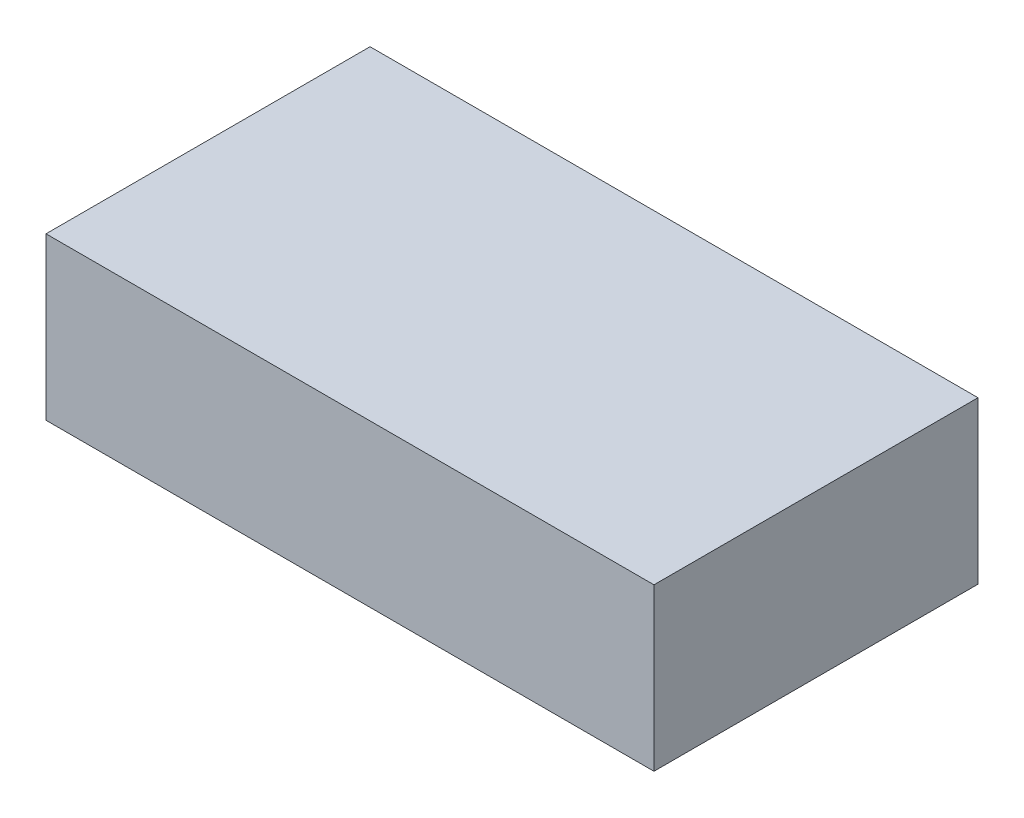
ISO-10303-21;
HEADER;
FILE_DESCRIPTION(('STEP AP214'),'2;1');
FILE_NAME('part.step','',(''),(''),'','','');
FILE_SCHEMA(('AUTOMOTIVE_DESIGN { 1 0 10303 214 1 1 1 1 }'));
ENDSEC;
DATA;
#1=APPLICATION_CONTEXT('core data for automotive mechanical design processes');
#2=APPLICATION_PROTOCOL_DEFINITION('international standard','automotive_design',2000,#1);
#3=PRODUCT_CONTEXT('',#1,'mechanical');
#4=PRODUCT('Part','Part','',(#3));
#5=PRODUCT_RELATED_PRODUCT_CATEGORY('part','',(#4));
#6=PRODUCT_DEFINITION_FORMATION('','',#4);
#7=PRODUCT_DEFINITION_CONTEXT('part definition',#1,'design');
#8=PRODUCT_DEFINITION('design','',#6,#7);
#9=PRODUCT_DEFINITION_SHAPE('','',#8);
#10=(LENGTH_UNIT() NAMED_UNIT(*) SI_UNIT(.MILLI.,.METRE.));
#11=(NAMED_UNIT(*) PLANE_ANGLE_UNIT() SI_UNIT($,.RADIAN.));
#12=(NAMED_UNIT(*) SI_UNIT($,.STERADIAN.) SOLID_ANGLE_UNIT());
#13=UNCERTAINTY_MEASURE_WITH_UNIT(LENGTH_MEASURE(1.E-05),#10,'distance_accuracy_value','');
#14=(GEOMETRIC_REPRESENTATION_CONTEXT(3) GLOBAL_UNCERTAINTY_ASSIGNED_CONTEXT((#13)) GLOBAL_UNIT_ASSIGNED_CONTEXT((#10,
#11,#12)) REPRESENTATION_CONTEXT('',''));
#15=CARTESIAN_POINT('',(0.,0.,0.));
#16=DIRECTION('',(0.,0.,1.));
#17=DIRECTION('',(1.,0.,0.));
#18=AXIS2_PLACEMENT_3D('',#15,#16,#17);
#19=CARTESIAN_POINT('',(75.057,39.878,-40.005));
#20=DIRECTION('',(-1.,0.,0.));
#21=DIRECTION('',(0.,0.,1.));
#22=AXIS2_PLACEMENT_3D('',#19,#20,#21);
#23=PLANE('',#22);
#24=DIRECTION('',(0.,0.,-1.));
#25=VECTOR('',#24,1.);
#26=CARTESIAN_POINT('',(75.057,0.,-40.005));
#27=LINE('',#26,#25);
#28=CARTESIAN_POINT('',(75.057,0.,40.005));
#29=VERTEX_POINT('',#28);
#30=CARTESIAN_POINT('',(75.057,0.,-40.005));
#31=VERTEX_POINT('',#30);
#32=EDGE_CURVE('E102',#29,#31,#27,.T.);
#33=ORIENTED_EDGE('',*,*,#32,.T.);
#34=DIRECTION('',(0.,-1.,0.));
#35=VECTOR('',#34,1.);
#36=CARTESIAN_POINT('',(75.057,39.878,-40.005));
#37=LINE('',#36,#35);
#38=CARTESIAN_POINT('',(75.057,39.878,-40.005));
#39=VERTEX_POINT('',#38);
#40=EDGE_CURVE('E11',#39,#31,#37,.T.);
#41=ORIENTED_EDGE('',*,*,#40,.F.);
#42=DIRECTION('',(0.,0.,-1.));
#43=VECTOR('',#42,1.);
#44=CARTESIAN_POINT('',(75.057,39.878,-40.005));
#45=LINE('',#44,#43);
#46=CARTESIAN_POINT('',(75.057,39.878,40.005));
#47=VERTEX_POINT('',#46);
#48=EDGE_CURVE('E90',#47,#39,#45,.T.);
#49=ORIENTED_EDGE('',*,*,#48,.F.);
#50=DIRECTION('',(0.,-1.,0.));
#51=VECTOR('',#50,1.);
#52=CARTESIAN_POINT('',(75.057,39.878,40.005));
#53=LINE('',#52,#51);
#54=EDGE_CURVE('E98',#47,#29,#53,.T.);
#55=ORIENTED_EDGE('',*,*,#54,.T.);
#56=EDGE_LOOP('',(#33,#41,#49,#55));
#57=FACE_BOUND('',#56,.T.);
#58=ADVANCED_FACE('F39',(#57),#23,.F.);
#59=CARTESIAN_POINT('',(-75.057,39.878,-40.005));
#60=DIRECTION('',(0.,0.,1.));
#61=DIRECTION('',(1.,0.,0.));
#62=AXIS2_PLACEMENT_3D('',#59,#60,#61);
#63=PLANE('',#62);
#64=DIRECTION('',(-1.,0.,0.));
#65=VECTOR('',#64,1.);
#66=CARTESIAN_POINT('',(-75.057,0.,-40.005));
#67=LINE('',#66,#65);
#68=CARTESIAN_POINT('',(-75.057,0.,-40.005));
#69=VERTEX_POINT('',#68);
#70=EDGE_CURVE('E94',#31,#69,#67,.T.);
#71=ORIENTED_EDGE('',*,*,#70,.T.);
#72=DIRECTION('',(0.,-1.,0.));
#73=VECTOR('',#72,1.);
#74=CARTESIAN_POINT('',(-75.057,39.878,-40.005));
#75=LINE('',#74,#73);
#76=CARTESIAN_POINT('',(-75.057,39.878,-40.005));
#77=VERTEX_POINT('',#76);
#78=EDGE_CURVE('E47',#77,#69,#75,.T.);
#79=ORIENTED_EDGE('',*,*,#78,.F.);
#80=DIRECTION('',(-1.,0.,0.));
#81=VECTOR('',#80,1.);
#82=CARTESIAN_POINT('',(-75.057,39.878,-40.005));
#83=LINE('',#82,#81);
#84=EDGE_CURVE('E85',#39,#77,#83,.T.);
#85=ORIENTED_EDGE('',*,*,#84,.F.);
#86=ORIENTED_EDGE('',*,*,#40,.T.);
#87=EDGE_LOOP('',(#71,#79,#85,#86));
#88=FACE_BOUND('',#87,.T.);
#89=ADVANCED_FACE('F93',(#88),#63,.F.);
#90=CARTESIAN_POINT('',(-75.057,39.878,-40.005));
#91=DIRECTION('',(1.,0.,0.));
#92=DIRECTION('',(0.,0.,-1.));
#93=AXIS2_PLACEMENT_3D('',#90,#91,#92);
#94=PLANE('',#93);
#95=DIRECTION('',(0.,0.,1.));
#96=VECTOR('',#95,1.);
#97=CARTESIAN_POINT('',(-75.057,0.,-40.005));
#98=LINE('',#97,#96);
#99=CARTESIAN_POINT('',(-75.057,0.,40.005));
#100=VERTEX_POINT('',#99);
#101=EDGE_CURVE('E72',#69,#100,#98,.T.);
#102=ORIENTED_EDGE('',*,*,#101,.T.);
#103=DIRECTION('',(0.,-1.,0.));
#104=VECTOR('',#103,1.);
#105=CARTESIAN_POINT('',(-75.057,39.878,40.005));
#106=LINE('',#105,#104);
#107=CARTESIAN_POINT('',(-75.057,39.878,40.005));
#108=VERTEX_POINT('',#107);
#109=EDGE_CURVE('E95',#108,#100,#106,.T.);
#110=ORIENTED_EDGE('',*,*,#109,.F.);
#111=DIRECTION('',(0.,0.,1.));
#112=VECTOR('',#111,1.);
#113=CARTESIAN_POINT('',(-75.057,39.878,-40.005));
#114=LINE('',#113,#112);
#115=EDGE_CURVE('E88',#77,#108,#114,.T.);
#116=ORIENTED_EDGE('',*,*,#115,.F.);
#117=ORIENTED_EDGE('',*,*,#78,.T.);
#118=EDGE_LOOP('',(#102,#110,#116,#117));
#119=FACE_BOUND('',#118,.T.);
#120=ADVANCED_FACE('F96',(#119),#94,.F.);
#121=CARTESIAN_POINT('',(-75.057,39.878,40.005));
#122=DIRECTION('',(0.,0.,-1.));
#123=DIRECTION('',(-1.,0.,0.));
#124=AXIS2_PLACEMENT_3D('',#121,#122,#123);
#125=PLANE('',#124);
#126=DIRECTION('',(1.,0.,0.));
#127=VECTOR('',#126,1.);
#128=CARTESIAN_POINT('',(-75.057,0.,40.005));
#129=LINE('',#128,#127);
#130=EDGE_CURVE('E78',#100,#29,#129,.T.);
#131=ORIENTED_EDGE('',*,*,#130,.T.);
#132=ORIENTED_EDGE('',*,*,#54,.F.);
#133=DIRECTION('',(1.,0.,0.));
#134=VECTOR('',#133,1.);
#135=CARTESIAN_POINT('',(-75.057,39.878,40.005));
#136=LINE('',#135,#134);
#137=EDGE_CURVE('E55',#108,#47,#136,.T.);
#138=ORIENTED_EDGE('',*,*,#137,.F.);
#139=ORIENTED_EDGE('',*,*,#109,.T.);
#140=EDGE_LOOP('',(#131,#132,#138,#139));
#141=FACE_BOUND('',#140,.T.);
#142=ADVANCED_FACE('F109',(#141),#125,.F.);
#143=CARTESIAN_POINT('',(0.,39.878,0.));
#144=DIRECTION('',(0.,1.,0.));
#145=DIRECTION('',(0.,0.,1.));
#146=AXIS2_PLACEMENT_3D('',#143,#144,#145);
#147=PLANE('',#146);
#148=ORIENTED_EDGE('',*,*,#48,.T.);
#149=ORIENTED_EDGE('',*,*,#84,.T.);
#150=ORIENTED_EDGE('',*,*,#115,.T.);
#151=ORIENTED_EDGE('',*,*,#137,.T.);
#152=EDGE_LOOP('',(#148,#149,#150,#151));
#153=FACE_BOUND('',#152,.T.);
#154=ADVANCED_FACE('F86',(#153),#147,.T.);
#155=CARTESIAN_POINT('',(0.,0.,0.));
#156=DIRECTION('',(0.,1.,0.));
#157=DIRECTION('',(0.,0.,1.));
#158=AXIS2_PLACEMENT_3D('',#155,#156,#157);
#159=PLANE('',#158);
#160=ORIENTED_EDGE('',*,*,#32,.F.);
#161=ORIENTED_EDGE('',*,*,#130,.F.);
#162=ORIENTED_EDGE('',*,*,#101,.F.);
#163=ORIENTED_EDGE('',*,*,#70,.F.);
#164=EDGE_LOOP('',(#160,#161,#162,#163));
#165=FACE_BOUND('',#164,.T.);
#166=ADVANCED_FACE('F112',(#165),#159,.F.);
#167=CLOSED_SHELL('',(#58,#89,#120,#142,#154,#166));
#168=MANIFOLD_SOLID_BREP('B2',#167);
#169=ADVANCED_BREP_SHAPE_REPRESENTATION('',(#18,#168),#14);
#170=SHAPE_DEFINITION_REPRESENTATION(#9,#169);
ENDSEC;
END-ISO-10303-21;
